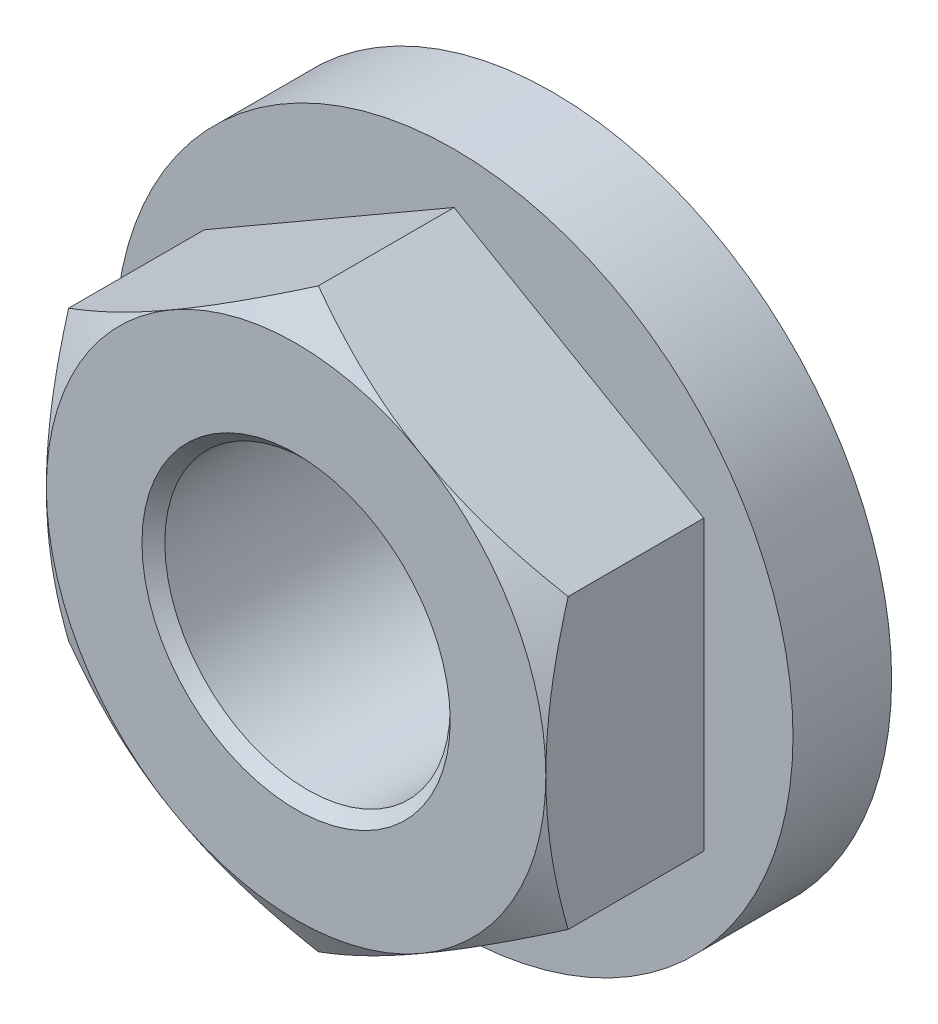
ISO-10303-21;
HEADER;
FILE_DESCRIPTION(('STEP AP214'),'2;1');
FILE_NAME('part.step','',(''),(''),'','','');
FILE_SCHEMA(('AUTOMOTIVE_DESIGN { 1 0 10303 214 1 1 1 1 }'));
ENDSEC;
DATA;
#1=APPLICATION_CONTEXT('core data for automotive mechanical design processes');
#2=APPLICATION_PROTOCOL_DEFINITION('international standard','automotive_design',2000,#1);
#3=PRODUCT_CONTEXT('',#1,'mechanical');
#4=PRODUCT('Part','Part','',(#3));
#5=PRODUCT_RELATED_PRODUCT_CATEGORY('part','',(#4));
#6=PRODUCT_DEFINITION_FORMATION('','',#4);
#7=PRODUCT_DEFINITION_CONTEXT('part definition',#1,'design');
#8=PRODUCT_DEFINITION('design','',#6,#7);
#9=PRODUCT_DEFINITION_SHAPE('','',#8);
#10=(LENGTH_UNIT() NAMED_UNIT(*) SI_UNIT(.MILLI.,.METRE.));
#11=(NAMED_UNIT(*) PLANE_ANGLE_UNIT() SI_UNIT($,.RADIAN.));
#12=(NAMED_UNIT(*) SI_UNIT($,.STERADIAN.) SOLID_ANGLE_UNIT());
#13=UNCERTAINTY_MEASURE_WITH_UNIT(LENGTH_MEASURE(1.E-05),#10,'distance_accuracy_value','');
#14=(GEOMETRIC_REPRESENTATION_CONTEXT(3) GLOBAL_UNCERTAINTY_ASSIGNED_CONTEXT((#13)) GLOBAL_UNIT_ASSIGNED_CONTEXT((#10,
#11,#12)) REPRESENTATION_CONTEXT('',''));
#15=CARTESIAN_POINT('',(0.,0.,0.));
#16=DIRECTION('',(0.,0.,1.));
#17=DIRECTION('',(1.,0.,0.));
#18=AXIS2_PLACEMENT_3D('',#15,#16,#17);
#19=CARTESIAN_POINT('',(0.,0.,-3.514725));
#20=DIRECTION('',(0.,0.,-1.));
#21=DIRECTION('',(-1.,0.,0.));
#22=AXIS2_PLACEMENT_3D('',#19,#20,#21);
#23=CYLINDRICAL_SURFACE('',#22,7.540625);
#24=CARTESIAN_POINT('',(0.,0.,-3.514725));
#25=DIRECTION('',(0.,0.,-1.));
#26=DIRECTION('',(-1.,0.,0.));
#27=AXIS2_PLACEMENT_3D('',#24,#25,#26);
#28=CIRCLE('',#27,7.540625);
#29=CARTESIAN_POINT('',(-7.540625,0.,-3.514725));
#30=VERTEX_POINT('',#29);
#31=EDGE_CURVE('E135',#30,#30,#28,.T.);
#32=ORIENTED_EDGE('',*,*,#31,.T.);
#33=EDGE_LOOP('',(#32));
#34=FACE_BOUND('',#33,.T.);
#35=CARTESIAN_POINT('',(0.,0.,-5.709285));
#36=DIRECTION('',(0.,0.,-1.));
#37=DIRECTION('',(-1.,0.,0.));
#38=AXIS2_PLACEMENT_3D('',#35,#36,#37);
#39=CIRCLE('',#38,7.540625);
#40=CARTESIAN_POINT('',(-7.540625,0.,-5.709285));
#41=VERTEX_POINT('',#40);
#42=EDGE_CURVE('E42',#41,#41,#39,.F.);
#43=ORIENTED_EDGE('',*,*,#42,.T.);
#44=EDGE_LOOP('',(#43));
#45=FACE_BOUND('',#44,.T.);
#46=ADVANCED_FACE('F37',(#34,#45),#23,.T.);
#47=CARTESIAN_POINT('',(-5.55625,9.62370729955457,-5.953125));
#48=DIRECTION('',(0.,0.,1.));
#49=DIRECTION('',(1.,0.,0.));
#50=AXIS2_PLACEMENT_3D('',#47,#48,#49);
#51=PLANE('',#50);
#52=CARTESIAN_POINT('',(0.,0.,-5.953125));
#53=DIRECTION('',(0.,0.,-1.));
#54=DIRECTION('',(-1.,0.,0.));
#55=AXIS2_PLACEMENT_3D('',#52,#53,#54);
#56=CIRCLE('',#55,3.429);
#57=CARTESIAN_POINT('',(-3.429,0.,-5.953125));
#58=VERTEX_POINT('',#57);
#59=EDGE_CURVE('E248',#58,#58,#56,.T.);
#60=ORIENTED_EDGE('',*,*,#59,.F.);
#61=EDGE_LOOP('',(#60));
#62=FACE_BOUND('',#61,.T.);
#63=CARTESIAN_POINT('',(0.,0.,-5.953125));
#64=DIRECTION('',(0.,0.,-1.));
#65=DIRECTION('',(-1.,0.,0.));
#66=AXIS2_PLACEMENT_3D('',#63,#64,#65);
#67=CIRCLE('',#66,5.461);
#68=CARTESIAN_POINT('',(-5.461,0.,-5.953125));
#69=VERTEX_POINT('',#68);
#70=EDGE_CURVE('E252',#69,#69,#67,.T.);
#71=ORIENTED_EDGE('',*,*,#70,.T.);
#72=EDGE_LOOP('',(#71));
#73=FACE_BOUND('',#72,.T.);
#74=ADVANCED_FACE('F223',(#62,#73),#51,.F.);
#75=CARTESIAN_POINT('',(5.55625,3.20790243318486,-5.953125));
#76=DIRECTION('',(0.5,0.866025403784439,0.));
#77=DIRECTION('',(-0.866025403784439,0.5,0.));
#78=AXIS2_PLACEMENT_3D('',#75,#76,#77);
#79=PLANE('',#78);
#80=DIRECTION('',(0.,0.,1.));
#81=VECTOR('',#80,1.);
#82=CARTESIAN_POINT('',(0.,6.41580486636972,-5.953125));
#83=LINE('',#82,#81);
#84=CARTESIAN_POINT('',(0.,6.41580486636972,-3.514725));
#85=VERTEX_POINT('',#84);
#86=CARTESIAN_POINT('',(0.,6.41580486636972,-0.496264233481805));
#87=VERTEX_POINT('',#86);
#88=EDGE_CURVE('E134',#85,#87,#83,.T.);
#89=ORIENTED_EDGE('',*,*,#88,.T.);
#90=CARTESIAN_POINT('',(-0.00020000000000129,6.41592033642355,-0.496330901948214));
#91=CARTESIAN_POINT('',(0.12193299556773,6.34540681855559,-0.45562556037127));
#92=CARTESIAN_POINT('',(0.244521362426352,6.27463039195025,-0.416767539363197));
#93=CARTESIAN_POINT('',(0.490693649442354,6.13250275577453,-0.343254933424579));
#94=CARTESIAN_POINT('',(0.614277974736486,6.06115131229835,-0.308602161801911));
#95=CARTESIAN_POINT('',(0.98700972080066,5.84595453837268,-0.211631885561129));
#96=CARTESIAN_POINT('',(1.2376284511895,5.70125974691872,-0.156476054502036));
#97=CARTESIAN_POINT('',(1.61267482827954,5.48472662014719,-0.0917989048470063));
#98=CARTESIAN_POINT('',(1.73598185211002,5.41353527674569,-0.0733741703626362));
#99=CARTESIAN_POINT('',(1.98315307742221,5.27083090327577,-0.0424783662403559));
#100=CARTESIAN_POINT('',(2.10701722869746,5.19931790219406,-0.0300067705620299));
#101=CARTESIAN_POINT('',(2.35496067331701,5.05616768769916,-0.0113350865982913));
#102=CARTESIAN_POINT('',(2.47903956167444,4.98453070810525,-0.00512788068338393));
#103=CARTESIAN_POINT('',(2.72730512667549,4.84119451732138,0.000888582586164164));
#104=CARTESIAN_POINT('',(2.85149179987105,4.76949530812215,0.000698037572721128));
#105=CARTESIAN_POINT('',(3.1917275625322,4.5730600989618,-0.0086182426929013));
#106=CARTESIAN_POINT('',(3.40766529229081,4.44838839255747,-0.024259659689411));
#107=CARTESIAN_POINT('',(3.83810650276474,4.19987304382004,-0.073859904974556));
#108=CARTESIAN_POINT('',(4.05260846955284,4.07603027555323,-0.107835688266667));
#109=CARTESIAN_POINT('',(4.48391602670835,3.82701474132597,-0.192765750048085));
#110=CARTESIAN_POINT('',(4.7006671909081,3.70187339832808,-0.244079888042122));
#111=CARTESIAN_POINT('',(5.13093704534075,3.45345698204721,-0.360542455292395));
#112=CARTESIAN_POINT('',(5.34446124641438,3.33017872707885,-0.425663525879434));
#113=CARTESIAN_POINT('',(5.55645,3.20778696313102,-0.496330901948212));
#114=B_SPLINE_CURVE_WITH_KNOTS('',3,(#90,#91,#92,#93,#94,#95,#96,#97,#98,#99,#100,#101,#102,
#103,#104,#105,#106,#107,#108,#109,#110,#111,#112,#113),.UNSPECIFIED.,.F.,.F.,(4,2,2,2,2,2,2,2,
2,2,2,4),(0.,0.440316908268041,0.880823012040823,1.76366572331169,2.19427472390783,
2.62484566732156,3.05492684132792,3.48499472977669,4.23370964386674,4.98311813377593,
5.74914806559356,6.51367405016872),.UNSPECIFIED.);
#115=CARTESIAN_POINT('',(2.778125,4.81185364977729,0.));
#116=VERTEX_POINT('',#115);
#117=EDGE_CURVE('E64',#87,#116,#114,.T.);
#118=ORIENTED_EDGE('',*,*,#117,.T.);
#119=CARTESIAN_POINT('',(5.55625,3.20790243318486,-0.496264233481803));
#120=VERTEX_POINT('',#119);
#121=EDGE_CURVE('E111',#116,#120,#114,.T.);
#122=ORIENTED_EDGE('',*,*,#121,.T.);
#123=DIRECTION('',(0.,0.,1.));
#124=VECTOR('',#123,1.);
#125=CARTESIAN_POINT('',(5.55625,3.20790243318486,-5.953125));
#126=LINE('',#125,#124);
#127=CARTESIAN_POINT('',(5.55625,3.20790243318486,-3.514725));
#128=VERTEX_POINT('',#127);
#129=EDGE_CURVE('E427',#128,#120,#126,.T.);
#130=ORIENTED_EDGE('',*,*,#129,.F.);
#131=DIRECTION('',(-0.866025403784439,0.5,0.));
#132=VECTOR('',#131,1.);
#133=CARTESIAN_POINT('',(5.55625,3.20790243318486,-3.514725));
#134=LINE('',#133,#132);
#135=EDGE_CURVE('E420',#128,#85,#134,.T.);
#136=ORIENTED_EDGE('',*,*,#135,.T.);
#137=EDGE_LOOP('',(#89,#118,#122,#130,#136));
#138=FACE_BOUND('',#137,.T.);
#139=ADVANCED_FACE('F39',(#138),#79,.T.);
#140=CARTESIAN_POINT('',(5.55625,-3.20790243318486,-5.953125));
#141=DIRECTION('',(1.,0.,0.));
#142=DIRECTION('',(0.,1.,0.));
#143=AXIS2_PLACEMENT_3D('',#140,#141,#142);
#144=PLANE('',#143);
#145=ORIENTED_EDGE('',*,*,#129,.T.);
#146=CARTESIAN_POINT('',(5.55625,-8.68399491005474,-2.74423112435443));
#147=CARTESIAN_POINT('',(5.55625,-8.44071238813783,-2.62594874146931));
#148=CARTESIAN_POINT('',(5.55625,-8.19687848881087,-2.5087813509356));
#149=CARTESIAN_POINT('',(5.55625,-7.7078149113579,-2.27730243738019));
#150=CARTESIAN_POINT('',(5.55625,-7.4625850263919,-2.16299135184691));
#151=CARTESIAN_POINT('',(5.55625,-6.96920529927723,-1.9372903200783));
#152=CARTESIAN_POINT('',(5.55625,-6.72104686846765,-1.82591908493359));
#153=CARTESIAN_POINT('',(5.55625,-6.22277921483376,-1.60764641646315));
#154=CARTESIAN_POINT('',(5.55625,-5.97267008295778,-1.50074477621043));
#155=CARTESIAN_POINT('',(5.55625,-5.46184428471539,-1.28916851922616));
#156=CARTESIAN_POINT('',(5.55625,-5.20104909427566,-1.18468247582605));
#157=CARTESIAN_POINT('',(5.55625,-4.67643244649863,-0.983456930570629));
#158=CARTESIAN_POINT('',(5.55625,-4.41261065705376,-0.886718288311942));
#159=CARTESIAN_POINT('',(5.55625,-3.88199419375103,-0.703477214265698));
#160=CARTESIAN_POINT('',(5.55625,-3.61520654148642,-0.616954646815536));
#161=CARTESIAN_POINT('',(5.55625,-3.07780215682032,-0.456878254095176));
#162=CARTESIAN_POINT('',(5.55625,-2.80718663728072,-0.383320416154831));
#163=CARTESIAN_POINT('',(5.55625,-2.26346638368936,-0.253041663234111));
#164=CARTESIAN_POINT('',(5.55625,-1.99038396194594,-0.196229098730025));
#165=CARTESIAN_POINT('',(5.55625,-1.44071558084913,-0.102629100235993));
#166=CARTESIAN_POINT('',(5.55625,-1.16412998782184,-0.0658395898427517));
#167=CARTESIAN_POINT('',(5.55625,-0.749562558844788,-0.0281119845697549));
#168=CARTESIAN_POINT('',(5.55625,-0.612340888492093,-0.0184532824013619));
#169=CARTESIAN_POINT('',(5.55625,-0.337616393410628,-0.00494664379792282));
#170=CARTESIAN_POINT('',(5.55625,-0.200113596220077,-0.00109816318166069));
#171=CARTESIAN_POINT('',(5.55625,0.0749421323474005,0.000691163131830924));
#172=CARTESIAN_POINT('',(5.55625,0.212495067091348,-0.00136851565554075));
#173=CARTESIAN_POINT('',(5.55625,0.487378845950658,-0.0113432883721766));
#174=CARTESIAN_POINT('',(5.55625,0.624709698074534,-0.0192581662155256));
#175=CARTESIAN_POINT('',(5.55625,0.95268850348551,-0.0449839380863666));
#176=CARTESIAN_POINT('',(5.55625,1.14313211985452,-0.0654579630895699));
#177=CARTESIAN_POINT('',(5.55625,1.52264130373992,-0.116565201640638));
#178=CARTESIAN_POINT('',(5.55625,1.71170668881073,-0.147199736111147));
#179=CARTESIAN_POINT('',(5.55625,2.27659405119699,-0.252722614390295));
#180=CARTESIAN_POINT('',(5.55625,2.64991074841381,-0.341212748653213));
#181=CARTESIAN_POINT('',(5.55625,3.20833213149729,-0.495145496191675));
#182=CARTESIAN_POINT('',(5.55625,3.39631843234373,-0.550739366801617));
#183=CARTESIAN_POINT('',(5.55625,3.77046569824234,-0.667817801385444));
#184=CARTESIAN_POINT('',(5.55625,3.95662664981014,-0.729302408839805));
#185=CARTESIAN_POINT('',(5.55625,4.3271813920907,-0.857165983664275));
#186=CARTESIAN_POINT('',(5.55625,4.51157570000081,-0.92354346585959));
#187=CARTESIAN_POINT('',(5.55625,4.87882686733377,-1.06040000970379));
#188=CARTESIAN_POINT('',(5.55625,5.06168375717878,-1.13087898997335));
#189=CARTESIAN_POINT('',(5.55625,5.53931341885732,-1.32014425816687));
#190=CARTESIAN_POINT('',(5.55625,5.83297980522752,-1.44171947509402));
#191=CARTESIAN_POINT('',(5.55625,6.41742433242896,-1.69164766096787));
#192=CARTESIAN_POINT('',(5.55624999999999,6.70820219189244,-1.82000128264598));
#193=CARTESIAN_POINT('',(5.55624999999999,7.28750450729358,-2.08193685782405));
#194=CARTESIAN_POINT('',(5.55624999999999,7.57602816714153,-2.21552056639607));
#195=CARTESIAN_POINT('',(5.55624999999999,8.1511607736309,-2.48670988867802));
#196=CARTESIAN_POINT('',(5.55624999999999,8.4377697868052,-2.62431536173138));
#197=CARTESIAN_POINT('',(5.55624999999999,9.00985857817239,-2.90290272486426));
#198=CARTESIAN_POINT('',(5.55624999999999,9.29533608720508,-3.04388926561472));
#199=CARTESIAN_POINT('',(5.55624999999999,9.86501872870687,-3.32841040468712));
#200=CARTESIAN_POINT('',(5.55624999999999,10.1492238521068,-3.47194502113488));
#201=CARTESIAN_POINT('',(5.55624999999999,11.0001638399101,-3.90555834554313));
#202=CARTESIAN_POINT('',(5.55624999999999,11.5653362706018,-4.19870204812455));
#203=CARTESIAN_POINT('',(5.55624999999999,12.6361469569359,-4.76078496572285));
#204=CARTESIAN_POINT('',(5.55624999999999,13.1420628655974,-5.02919773815537));
#205=CARTESIAN_POINT('',(5.55624999999999,14.1521616738707,-5.5693281145757));
#206=CARTESIAN_POINT('',(5.55624999999999,14.6563444780897,-5.84104589685548));
#207=CARTESIAN_POINT('',(5.55624999999999,15.6618068300488,-6.38609209435569));
#208=CARTESIAN_POINT('',(5.55624999999999,16.1630905297018,-6.65941286244854));
#209=CARTESIAN_POINT('',(5.55624999999999,17.1645728087885,-7.20795098937644));
#210=CARTESIAN_POINT('',(5.55624999999999,17.6647714635511,-7.48316821062431));
#211=CARTESIAN_POINT('',(5.55624999999999,18.1645847485322,-7.75907911977834));
#212=B_SPLINE_CURVE_WITH_KNOTS('',3,(#146,#147,#148,#149,#150,#151,#152,#153,#154,#155,#156,
#157,#158,#159,#160,#161,#162,#163,#164,#165,#166,#167,#168,#169,#170,#171,#172,#173,#174,#175,
#176,#177,#178,#179,#180,#181,#182,#183,#184,#185,#186,#187,#188,#189,#190,#191,#192,#193,#194,
#195,#196,#197,#198,#199,#200,#201,#202,#203,#204,#205,#206,#207,#208,#209,#210,#211),
.UNSPECIFIED.,.F.,.F.,(4,2,2,2,2,2,2,2,2,2,2,2,2,2,2,2,2,2,2,2,2,2,2,2,2,2,2,2,2,2,2,2,4),(0.,
0.811547630396048,1.62321880955349,2.43919539124873,3.25513415408659,4.09788141298698,
4.94072204796686,5.78187270596739,6.62276256330883,7.45896078973326,8.29507228534598,
8.70765151088547,9.12019209215055,9.53276929698372,9.9453312764292,10.5196314608684,
11.0940063368051,12.2433452126182,12.8313978126471,13.4194547535213,14.0073339258551,
14.5952014378355,15.5485884923271,16.5020675219184,17.4558693020792,18.4096377639481,
19.3648033529993,20.3199757393717,22.229942984196,23.9480593030972,25.6662687221983,
27.3791293174056,29.0918669266135),.UNSPECIFIED.);
#213=CARTESIAN_POINT('',(5.55625,0.,0.));
#214=VERTEX_POINT('',#213);
#215=EDGE_CURVE('E114',#120,#214,#212,.F.);
#216=ORIENTED_EDGE('',*,*,#215,.T.);
#217=CARTESIAN_POINT('',(5.55625,-3.20790243318486,-0.496264233481805));
#218=VERTEX_POINT('',#217);
#219=EDGE_CURVE('E145',#214,#218,#212,.F.);
#220=ORIENTED_EDGE('',*,*,#219,.T.);
#221=DIRECTION('',(0.,0.,1.));
#222=VECTOR('',#221,1.);
#223=CARTESIAN_POINT('',(5.55625,-3.20790243318486,-5.953125));
#224=LINE('',#223,#222);
#225=CARTESIAN_POINT('',(5.55625,-3.20790243318486,-3.514725));
#226=VERTEX_POINT('',#225);
#227=EDGE_CURVE('E434',#226,#218,#224,.T.);
#228=ORIENTED_EDGE('',*,*,#227,.F.);
#229=DIRECTION('',(0.,1.,0.));
#230=VECTOR('',#229,1.);
#231=CARTESIAN_POINT('',(5.55625,-3.20790243318486,-3.514725));
#232=LINE('',#231,#230);
#233=EDGE_CURVE('E423',#226,#128,#232,.T.);
#234=ORIENTED_EDGE('',*,*,#233,.T.);
#235=EDGE_LOOP('',(#145,#216,#220,#228,#234));
#236=FACE_BOUND('',#235,.T.);
#237=ADVANCED_FACE('F201',(#236),#144,.T.);
#238=CARTESIAN_POINT('',(0.,-6.41580486636972,-5.953125));
#239=DIRECTION('',(0.5,-0.866025403784439,0.));
#240=DIRECTION('',(0.866025403784439,0.5,0.));
#241=AXIS2_PLACEMENT_3D('',#238,#239,#240);
#242=PLANE('',#241);
#243=ORIENTED_EDGE('',*,*,#227,.T.);
#244=CARTESIAN_POINT('',(5.55645,-3.20778696313103,-0.496330901948214));
#245=CARTESIAN_POINT('',(5.43431700443226,-3.27830048099899,-0.455625560371269));
#246=CARTESIAN_POINT('',(5.31172863757364,-3.34907690760433,-0.416767539363196));
#247=CARTESIAN_POINT('',(5.06555635055764,-3.49120454378005,-0.343254933424579));
#248=CARTESIAN_POINT('',(4.94197202526351,-3.56255598725623,-0.308602161801911));
#249=CARTESIAN_POINT('',(4.56924027919933,-3.7777527611819,-0.21163188556113));
#250=CARTESIAN_POINT('',(4.31862154881049,-3.92244755263586,-0.156476054502037));
#251=CARTESIAN_POINT('',(3.94357517172046,-4.13898067940739,-0.091798904847007));
#252=CARTESIAN_POINT('',(3.82026814788997,-4.21017202280889,-0.073374170362637));
#253=CARTESIAN_POINT('',(3.57309692257778,-4.35287639627881,-0.0424783662403568));
#254=CARTESIAN_POINT('',(3.44923277130253,-4.42438939736052,-0.0300067705620312));
#255=CARTESIAN_POINT('',(3.20128932668298,-4.56753961185542,-0.0113350865982923));
#256=CARTESIAN_POINT('',(3.07721043832556,-4.63917659144933,-0.00512788068338454));
#257=CARTESIAN_POINT('',(2.82894487332451,-4.7825127822332,0.000888582586163022));
#258=CARTESIAN_POINT('',(2.70475820012895,-4.85421199143242,0.000698037572719024));
#259=CARTESIAN_POINT('',(2.36452243746779,-5.05064720059278,-0.0086182426929045));
#260=CARTESIAN_POINT('',(2.14858470770919,-5.17531890699711,-0.0242596596894132));
#261=CARTESIAN_POINT('',(1.71814349723526,-5.42383425573454,-0.0738599049745579));
#262=CARTESIAN_POINT('',(1.50364153044716,-5.54767702400135,-0.10783568826667));
#263=CARTESIAN_POINT('',(1.07233397329164,-5.79669255822861,-0.192765750048088));
#264=CARTESIAN_POINT('',(0.855582809091897,-5.92183390122649,-0.244079888042125));
#265=CARTESIAN_POINT('',(0.425312954659247,-6.17025031750737,-0.360542455292398));
#266=CARTESIAN_POINT('',(0.21178875358562,-6.29352857247572,-0.425663525879437));
#267=CARTESIAN_POINT('',(-0.00020000000000079,-6.41592033642356,-0.496330901948215));
#268=B_SPLINE_CURVE_WITH_KNOTS('',3,(#244,#245,#246,#247,#248,#249,#250,#251,#252,#253,#254,
#255,#256,#257,#258,#259,#260,#261,#262,#263,#264,#265,#266,#267),.UNSPECIFIED.,.F.,.F.,(4,2,2,
2,2,2,2,2,2,2,2,4),(0.,0.440316908268041,0.880823012040823,1.76366572331169,2.19427472390783,
2.62484566732156,3.05492684132792,3.48499472977669,4.23370964386674,4.98311813377593,
5.74914806559356,6.51367405016872),.UNSPECIFIED.);
#269=CARTESIAN_POINT('',(2.778125,-4.81185364977729,0.));
#270=VERTEX_POINT('',#269);
#271=EDGE_CURVE('E195',#218,#270,#268,.T.);
#272=ORIENTED_EDGE('',*,*,#271,.T.);
#273=CARTESIAN_POINT('',(0.,-6.41580486636972,-0.496264233481806));
#274=VERTEX_POINT('',#273);
#275=EDGE_CURVE('E188',#270,#274,#268,.T.);
#276=ORIENTED_EDGE('',*,*,#275,.T.);
#277=DIRECTION('',(0.,0.,1.));
#278=VECTOR('',#277,1.);
#279=CARTESIAN_POINT('',(0.,-6.41580486636972,-5.953125));
#280=LINE('',#279,#278);
#281=CARTESIAN_POINT('',(0.,-6.41580486636972,-3.514725));
#282=VERTEX_POINT('',#281);
#283=EDGE_CURVE('E438',#282,#274,#280,.T.);
#284=ORIENTED_EDGE('',*,*,#283,.F.);
#285=DIRECTION('',(0.866025403784439,0.5,0.));
#286=VECTOR('',#285,1.);
#287=CARTESIAN_POINT('',(0.,-6.41580486636972,-3.514725));
#288=LINE('',#287,#286);
#289=EDGE_CURVE('E444',#282,#226,#288,.T.);
#290=ORIENTED_EDGE('',*,*,#289,.T.);
#291=EDGE_LOOP('',(#243,#272,#276,#284,#290));
#292=FACE_BOUND('',#291,.T.);
#293=ADVANCED_FACE('F197',(#292),#242,.T.);
#294=CARTESIAN_POINT('',(-5.55625,-3.20790243318486,-5.953125));
#295=DIRECTION('',(-0.5,-0.866025403784439,0.));
#296=DIRECTION('',(0.866025403784439,-0.5,0.));
#297=AXIS2_PLACEMENT_3D('',#294,#295,#296);
#298=PLANE('',#297);
#299=ORIENTED_EDGE('',*,*,#283,.T.);
#300=CARTESIAN_POINT('',(0.000199999999999385,-6.41592033642356,-0.496330901948215));
#301=CARTESIAN_POINT('',(-0.121932995567732,-6.34540681855559,-0.455625560371271));
#302=CARTESIAN_POINT('',(-0.244521362426354,-6.27463039195025,-0.416767539363198));
#303=CARTESIAN_POINT('',(-0.490693649442357,-6.13250275577453,-0.343254933424581));
#304=CARTESIAN_POINT('',(-0.614277974736488,-6.06115131229835,-0.308602161801913));
#305=CARTESIAN_POINT('',(-0.987009720800663,-5.84595453837268,-0.211631885561131));
#306=CARTESIAN_POINT('',(-1.2376284511895,-5.70125974691872,-0.156476054502039));
#307=CARTESIAN_POINT('',(-1.61267482827954,-5.48472662014719,-0.0917989048470077));
#308=CARTESIAN_POINT('',(-1.73598185211002,-5.41353527674569,-0.0733741703626372));
#309=CARTESIAN_POINT('',(-1.98315307742222,-5.27083090327577,-0.0424783662403569));
#310=CARTESIAN_POINT('',(-2.10701722869746,-5.19931790219406,-0.0300067705620317));
#311=CARTESIAN_POINT('',(-2.35496067331702,-5.05616768769916,-0.011335086598293));
#312=CARTESIAN_POINT('',(-2.47903956167444,-4.98453070810525,-0.00512788068338511));
#313=CARTESIAN_POINT('',(-2.72730512667549,-4.84119451732138,0.000888582586162839));
#314=CARTESIAN_POINT('',(-2.85149179987105,-4.76949530812216,0.000698037572719076));
#315=CARTESIAN_POINT('',(-3.19172756253221,-4.5730600989618,-0.00861824269290391));
#316=CARTESIAN_POINT('',(-3.40766529229081,-4.44838839255747,-0.0242596596894124));
#317=CARTESIAN_POINT('',(-3.83810650276474,-4.19987304382004,-0.0738599049745569));
#318=CARTESIAN_POINT('',(-4.05260846955284,-4.07603027555323,-0.107835688266669));
#319=CARTESIAN_POINT('',(-4.48391602670836,-3.82701474132597,-0.192765750048088));
#320=CARTESIAN_POINT('',(-4.7006671909081,-3.70187339832808,-0.244079888042125));
#321=CARTESIAN_POINT('',(-5.13093704534075,-3.45345698204721,-0.360542455292398));
#322=CARTESIAN_POINT('',(-5.34446124641438,-3.33017872707885,-0.425663525879437));
#323=CARTESIAN_POINT('',(-5.55645,-3.20778696313102,-0.496330901948215));
#324=B_SPLINE_CURVE_WITH_KNOTS('',3,(#300,#301,#302,#303,#304,#305,#306,#307,#308,#309,#310,
#311,#312,#313,#314,#315,#316,#317,#318,#319,#320,#321,#322,#323),.UNSPECIFIED.,.F.,.F.,(4,2,2,
2,2,2,2,2,2,2,2,4),(0.,0.440316908268041,0.880823012040824,1.76366572331169,2.19427472390783,
2.62484566732156,3.05492684132792,3.4849947297767,4.23370964386675,4.98311813377593,
5.74914806559357,6.51367405016873),.UNSPECIFIED.);
#325=CARTESIAN_POINT('',(-2.778125,-4.81185364977729,0.));
#326=VERTEX_POINT('',#325);
#327=EDGE_CURVE('E196',#274,#326,#324,.T.);
#328=ORIENTED_EDGE('',*,*,#327,.T.);
#329=CARTESIAN_POINT('',(-5.55625,-3.20790243318534,-0.496264233481485));
#330=VERTEX_POINT('',#329);
#331=EDGE_CURVE('E182',#326,#330,#324,.T.);
#332=ORIENTED_EDGE('',*,*,#331,.T.);
#333=DIRECTION('',(0.,0.,1.));
#334=VECTOR('',#333,1.);
#335=CARTESIAN_POINT('',(-5.55625,-3.20790243318486,-5.953125));
#336=LINE('',#335,#334);
#337=CARTESIAN_POINT('',(-5.55625,-3.20790243318486,-3.514725));
#338=VERTEX_POINT('',#337);
#339=EDGE_CURVE('E415',#338,#330,#336,.T.);
#340=ORIENTED_EDGE('',*,*,#339,.F.);
#341=DIRECTION('',(0.866025403784439,-0.5,0.));
#342=VECTOR('',#341,1.);
#343=CARTESIAN_POINT('',(-5.55625,-3.20790243318486,-3.514725));
#344=LINE('',#343,#342);
#345=EDGE_CURVE('E443',#338,#282,#344,.T.);
#346=ORIENTED_EDGE('',*,*,#345,.T.);
#347=EDGE_LOOP('',(#299,#328,#332,#340,#346));
#348=FACE_BOUND('',#347,.T.);
#349=ADVANCED_FACE('F200',(#348),#298,.T.);
#350=CARTESIAN_POINT('',(-5.55625,3.20790243318486,-5.953125));
#351=DIRECTION('',(-1.,0.,0.));
#352=DIRECTION('',(0.,-1.,0.));
#353=AXIS2_PLACEMENT_3D('',#350,#351,#352);
#354=PLANE('',#353);
#355=ORIENTED_EDGE('',*,*,#339,.T.);
#356=CARTESIAN_POINT('',(-5.55625,-8.68399490865763,-2.74423112367499));
#357=CARTESIAN_POINT('',(-5.55625,-8.44071238678772,-2.62594874081824));
#358=CARTESIAN_POINT('',(-5.55625,-8.1968784875078,-2.50878135031289));
#359=CARTESIAN_POINT('',(-5.55625,-7.70781491014905,-2.27730243681407));
#360=CARTESIAN_POINT('',(-5.55625,-7.46258502523023,-2.16299135130901));
#361=CARTESIAN_POINT('',(-5.55625,-6.96920529821065,-1.93729031959688));
#362=CARTESIAN_POINT('',(-5.55625,-6.72104686744898,-1.8259190844804));
#363=CARTESIAN_POINT('',(-5.55625,-6.22277921391125,-1.60764641606598));
#364=CARTESIAN_POINT('',(-5.55625,-5.9726700820835,-1.50074477584103));
#365=CARTESIAN_POINT('',(-5.55625,-5.46184428394125,-1.28916851891306));
#366=CARTESIAN_POINT('',(-5.55625,-5.20104909355346,-1.18468247554142));
#367=CARTESIAN_POINT('',(-5.55625,-4.67643244588114,-0.983456930341409));
#368=CARTESIAN_POINT('',(-5.55625,-4.41261065648904,-0.886718288109666));
#369=CARTESIAN_POINT('',(-5.55625,-3.88199419329285,-0.703477214114723));
#370=CARTESIAN_POINT('',(-5.55625,-3.61520654108199,-0.616954646688927));
#371=CARTESIAN_POINT('',(-5.55625,-3.07780215652486,-0.456878254013309));
#372=CARTESIAN_POINT('',(-5.55625,-2.80718663704047,-0.383320416093342));
#373=CARTESIAN_POINT('',(-5.55625,-2.26346638358799,-0.253041663213731));
#374=CARTESIAN_POINT('',(-5.55625,-1.99038396192862,-0.196229098728786));
#375=CARTESIAN_POINT('',(-5.55625,-1.44071558100195,-0.102629100260319));
#376=CARTESIAN_POINT('',(-5.55625,-1.16412998806076,-0.0658395898735119));
#377=CARTESIAN_POINT('',(-5.55625,-0.749562559212246,-0.028111984598734));
#378=CARTESIAN_POINT('',(-5.55625,-0.61234088890178,-0.018453282427893));
#379=CARTESIAN_POINT('',(-5.55625,-0.337616393904681,-0.00494664381583912));
#380=CARTESIAN_POINT('',(-5.55625,-0.200113596756267,-0.00109816319341067));
#381=CARTESIAN_POINT('',(-5.55625,0.0749421317272436,0.000691163136054456));
#382=CARTESIAN_POINT('',(-5.55625,0.212495066429362,-0.00136851564150872));
#383=CARTESIAN_POINT('',(-5.55625,0.48737884520557,-0.0113432883351523));
#384=CARTESIAN_POINT('',(-5.55625,0.624709697288174,-0.0192581661653177));
#385=CARTESIAN_POINT('',(-5.55625,0.952688502635255,-0.0449839380037341));
#386=CARTESIAN_POINT('',(-5.55625,1.14313211898183,-0.0654579629882622));
#387=CARTESIAN_POINT('',(-5.55625,1.52264130282336,-0.116565201500979));
#388=CARTESIAN_POINT('',(-5.55625,1.71170668787275,-0.147199735951811));
#389=CARTESIAN_POINT('',(-5.55625,2.27659405019588,-0.252722614171514));
#390=CARTESIAN_POINT('',(-5.55625,2.64991074737226,-0.341212748394274));
#391=CARTESIAN_POINT('',(-5.55625,3.20833213039524,-0.495145495873464));
#392=CARTESIAN_POINT('',(-5.55625,3.39631843122109,-0.55073936646351));
#393=CARTESIAN_POINT('',(-5.55625,3.77046569707873,-0.667817801008148));
#394=CARTESIAN_POINT('',(-5.55625,3.95662664862616,-0.729302408443215));
#395=CARTESIAN_POINT('',(-5.55625,4.32718139086614,-0.85716598322978));
#396=CARTESIAN_POINT('',(-5.55625,4.51157569875603,-0.923543465406485));
#397=CARTESIAN_POINT('',(-5.55625,4.87882686604855,-1.06040000921411));
#398=CARTESIAN_POINT('',(-5.55625,5.06168375587333,-1.13087898946569));
#399=CARTESIAN_POINT('',(-5.55625,5.53931341753975,-1.3201442576291));
#400=CARTESIAN_POINT('',(-5.55625,5.83297980391751,-1.44171947454583));
#401=CARTESIAN_POINT('',(-5.55625,6.4174243311331,-1.69164766040173));
#402=CARTESIAN_POINT('',(-5.55625,6.70820219060318,-1.82000128207232));
#403=CARTESIAN_POINT('',(-5.55625,7.28750450601683,-2.08193685723748));
#404=CARTESIAN_POINT('',(-5.55625,7.57602816587069,-2.2155205658041));
#405=CARTESIAN_POINT('',(-5.55625,8.15116077237124,-2.48670988807679));
#406=CARTESIAN_POINT('',(-5.55625,8.4377697855508,-2.62431536112629));
#407=CARTESIAN_POINT('',(-5.55625,9.00985857692835,-2.90290272425271));
#408=CARTESIAN_POINT('',(-5.55625,9.29533608596613,-3.04388926500057));
#409=CARTESIAN_POINT('',(-5.55625,9.86501872747772,-3.32841040406864));
#410=CARTESIAN_POINT('',(-5.55625,10.1492238508824,-3.47194502051465));
#411=CARTESIAN_POINT('',(-5.55625,11.0001638386992,-3.9055583449186));
#412=CARTESIAN_POINT('',(-5.55625,11.5653362693993,-4.19870204749842));
#413=CARTESIAN_POINT('',(-5.55625,12.6361469557419,-4.76078496509157));
#414=CARTESIAN_POINT('',(-5.55625,13.1420628644035,-5.02919773752034));
#415=CARTESIAN_POINT('',(-5.55625,14.1521616726768,-5.56932811393393));
#416=CARTESIAN_POINT('',(-5.55625,14.6563444768956,-5.84104589621072));
#417=CARTESIAN_POINT('',(-5.55625,15.6618068288529,-6.38609209370488));
#418=CARTESIAN_POINT('',(-5.55625,16.1630905285044,-6.65941286179464));
#419=CARTESIAN_POINT('',(-5.55625,17.1645728075876,-7.20795098871674));
#420=CARTESIAN_POINT('',(-5.55625,17.6647714623484,-7.48316820996187));
#421=CARTESIAN_POINT('',(-5.55625,18.1645847473276,-7.75907911911329));
#422=B_SPLINE_CURVE_WITH_KNOTS('',3,(#356,#357,#358,#359,#360,#361,#362,#363,#364,#365,#366,
#367,#368,#369,#370,#371,#372,#373,#374,#375,#376,#377,#378,#379,#380,#381,#382,#383,#384,#385,
#386,#387,#388,#389,#390,#391,#392,#393,#394,#395,#396,#397,#398,#399,#400,#401,#402,#403,#404,
#405,#406,#407,#408,#409,#410,#411,#412,#413,#414,#415,#416,#417,#418,#419,#420,#421),
.UNSPECIFIED.,.F.,.F.,(4,2,2,2,2,2,2,2,2,2,2,2,2,2,2,2,2,2,2,2,2,2,2,2,2,2,2,2,2,2,2,2,4),(0.,
0.811547630232006,1.62321880922538,2.43919539075479,3.25513415342684,4.09788141215085,
4.9407220469543,5.78187270477897,6.62276256194471,7.45896078811112,8.29507228346621,
8.70765150887994,9.1201920900193,9.53276929472667,9.94533127404636,10.5196314584127,
11.0940063342765,12.2433452099435,12.8313978098963,13.4194547506943,14.007333922952,
14.5952014348564,15.5485884893569,16.5020675189572,17.4558692991273,18.4096377610053,
19.3648033500667,20.3199757364494,22.2299429812938,23.9480593001902,25.6662687192865,
27.3791293144852,29.0918669236843),.UNSPECIFIED.);
#423=CARTESIAN_POINT('',(-5.55625,0.,0.));
#424=VERTEX_POINT('',#423);
#425=EDGE_CURVE('E405',#330,#424,#422,.T.);
#426=ORIENTED_EDGE('',*,*,#425,.T.);
#427=CARTESIAN_POINT('',(-5.55625,3.20790243318486,-0.496264233481806));
#428=VERTEX_POINT('',#427);
#429=EDGE_CURVE('E175',#424,#428,#422,.T.);
#430=ORIENTED_EDGE('',*,*,#429,.T.);
#431=DIRECTION('',(0.,0.,1.));
#432=VECTOR('',#431,1.);
#433=CARTESIAN_POINT('',(-5.55625,3.20790243318486,-5.953125));
#434=LINE('',#433,#432);
#435=CARTESIAN_POINT('',(-5.55625,3.20790243318486,-3.514725));
#436=VERTEX_POINT('',#435);
#437=EDGE_CURVE('E419',#436,#428,#434,.T.);
#438=ORIENTED_EDGE('',*,*,#437,.F.);
#439=DIRECTION('',(0.,-1.,0.));
#440=VECTOR('',#439,1.);
#441=CARTESIAN_POINT('',(-5.55625,3.20790243318486,-3.514725));
#442=LINE('',#441,#440);
#443=EDGE_CURVE('E137',#436,#338,#442,.T.);
#444=ORIENTED_EDGE('',*,*,#443,.T.);
#445=EDGE_LOOP('',(#355,#426,#430,#438,#444));
#446=FACE_BOUND('',#445,.T.);
#447=ADVANCED_FACE('F207',(#446),#354,.T.);
#448=CARTESIAN_POINT('',(0.,6.41580486636972,-5.953125));
#449=DIRECTION('',(-0.5,0.866025403784439,0.));
#450=DIRECTION('',(-0.866025403784439,-0.5,0.));
#451=AXIS2_PLACEMENT_3D('',#448,#449,#450);
#452=PLANE('',#451);
#453=ORIENTED_EDGE('',*,*,#437,.T.);
#454=CARTESIAN_POINT('',(-5.55645,3.20778696313102,-0.496330901948216));
#455=CARTESIAN_POINT('',(-5.43431700443227,3.27830048099899,-0.455625560371271));
#456=CARTESIAN_POINT('',(-5.31172863757365,3.34907690760433,-0.416767539363198));
#457=CARTESIAN_POINT('',(-5.06555635055765,3.49120454378004,-0.34325493342458));
#458=CARTESIAN_POINT('',(-4.94197202526351,3.56255598725623,-0.308602161801912));
#459=CARTESIAN_POINT('',(-4.56924027919934,3.7777527611819,-0.211631885561131));
#460=CARTESIAN_POINT('',(-4.3186215488105,3.92244755263586,-0.156476054502038));
#461=CARTESIAN_POINT('',(-3.94357517172046,4.13898067940738,-0.0917989048470075));
#462=CARTESIAN_POINT('',(-3.82026814788998,4.21017202280889,-0.0733741703626371));
#463=CARTESIAN_POINT('',(-3.57309692257779,4.35287639627881,-0.0424783662403571));
#464=CARTESIAN_POINT('',(-3.44923277130254,4.42438939736052,-0.0300067705620319));
#465=CARTESIAN_POINT('',(-3.20128932668299,4.56753961185542,-0.0113350865982928));
#466=CARTESIAN_POINT('',(-3.07721043832556,4.63917659144933,-0.00512788068338447));
#467=CARTESIAN_POINT('',(-2.82894487332451,4.7825127822332,0.000888582586163694));
#468=CARTESIAN_POINT('',(-2.70475820012895,4.85421199143242,0.00069803757271971));
#469=CARTESIAN_POINT('',(-2.36452243746779,5.05064720059278,-0.00861824269290365));
#470=CARTESIAN_POINT('',(-2.14858470770919,5.1753189069971,-0.0242596596894121));
#471=CARTESIAN_POINT('',(-1.71814349723526,5.42383425573453,-0.0738599049745566));
#472=CARTESIAN_POINT('',(-1.50364153044716,5.54767702400135,-0.107835688266668));
#473=CARTESIAN_POINT('',(-1.07233397329164,5.79669255822861,-0.192765750048087));
#474=CARTESIAN_POINT('',(-0.855582809091901,5.92183390122649,-0.244079888042124));
#475=CARTESIAN_POINT('',(-0.42531295465925,6.17025031750736,-0.360542455292397));
#476=CARTESIAN_POINT('',(-0.211788753585623,6.29352857247572,-0.425663525879436));
#477=CARTESIAN_POINT('',(0.000199999999998121,6.41592033642355,-0.496330901948214));
#478=B_SPLINE_CURVE_WITH_KNOTS('',3,(#454,#455,#456,#457,#458,#459,#460,#461,#462,#463,#464,
#465,#466,#467,#468,#469,#470,#471,#472,#473,#474,#475,#476,#477),.UNSPECIFIED.,.F.,.F.,(4,2,2,
2,2,2,2,2,2,2,2,4),(0.,0.440316908268042,0.880823012040824,1.76366572331169,2.19427472390783,
2.62484566732156,3.05492684132792,3.4849947297767,4.23370964386675,4.98311813377593,
5.74914806559356,6.51367405016873),.UNSPECIFIED.);
#479=CARTESIAN_POINT('',(-2.778125,4.81185364977729,0.));
#480=VERTEX_POINT('',#479);
#481=EDGE_CURVE('E416',#428,#480,#478,.T.);
#482=ORIENTED_EDGE('',*,*,#481,.T.);
#483=EDGE_CURVE('E120',#480,#87,#478,.T.);
#484=ORIENTED_EDGE('',*,*,#483,.T.);
#485=ORIENTED_EDGE('',*,*,#88,.F.);
#486=DIRECTION('',(-0.866025403784439,-0.5,0.));
#487=VECTOR('',#486,1.);
#488=CARTESIAN_POINT('',(0.,6.41580486636972,-3.514725));
#489=LINE('',#488,#487);
#490=EDGE_CURVE('E418',#85,#436,#489,.T.);
#491=ORIENTED_EDGE('',*,*,#490,.T.);
#492=EDGE_LOOP('',(#453,#482,#484,#485,#491));
#493=FACE_BOUND('',#492,.T.);
#494=ADVANCED_FACE('F211',(#493),#452,.T.);
#495=CARTESIAN_POINT('',(0.,0.,-3.514725));
#496=DIRECTION('',(0.,0.,-1.));
#497=DIRECTION('',(-1.,0.,0.));
#498=AXIS2_PLACEMENT_3D('',#495,#496,#497);
#499=PLANE('',#498);
#500=ORIENTED_EDGE('',*,*,#135,.F.);
#501=ORIENTED_EDGE('',*,*,#233,.F.);
#502=ORIENTED_EDGE('',*,*,#289,.F.);
#503=ORIENTED_EDGE('',*,*,#345,.F.);
#504=ORIENTED_EDGE('',*,*,#443,.F.);
#505=ORIENTED_EDGE('',*,*,#490,.F.);
#506=EDGE_LOOP('',(#500,#501,#502,#503,#504,#505));
#507=FACE_BOUND('',#506,.T.);
#508=ORIENTED_EDGE('',*,*,#31,.F.);
#509=EDGE_LOOP('',(#508));
#510=FACE_BOUND('',#509,.T.);
#511=ADVANCED_FACE('F162',(#507,#510),#499,.F.);
#512=CARTESIAN_POINT('',(0.,0.,0.));
#513=DIRECTION('',(0.,0.,-1.));
#514=DIRECTION('',(1.,0.,0.));
#515=AXIS2_PLACEMENT_3D('',#512,#513,#514);
#516=CONICAL_SURFACE('',#515,5.55625,1.0471975511966);
#517=CARTESIAN_POINT('',(0.,0.,0.));
#518=DIRECTION('',(0.,0.,1.));
#519=DIRECTION('',(1.,0.,0.));
#520=AXIS2_PLACEMENT_3D('',#517,#518,#519);
#521=CIRCLE('',#520,5.55625);
#522=EDGE_CURVE('E49',#270,#214,#521,.T.);
#523=ORIENTED_EDGE('',*,*,#522,.F.);
#524=ORIENTED_EDGE('',*,*,#271,.F.);
#525=ORIENTED_EDGE('',*,*,#219,.F.);
#526=EDGE_LOOP('',(#523,#524,#525));
#527=FACE_BOUND('',#526,.T.);
#528=ADVANCED_FACE('F219',(#527),#516,.T.);
#529=EDGE_CURVE('E409',#326,#270,#521,.T.);
#530=ORIENTED_EDGE('',*,*,#529,.F.);
#531=ORIENTED_EDGE('',*,*,#327,.F.);
#532=ORIENTED_EDGE('',*,*,#275,.F.);
#533=EDGE_LOOP('',(#530,#531,#532));
#534=FACE_BOUND('',#533,.T.);
#535=ADVANCED_FACE('F350',(#534),#516,.T.);
#536=EDGE_CURVE('E403',#424,#326,#521,.T.);
#537=ORIENTED_EDGE('',*,*,#536,.F.);
#538=ORIENTED_EDGE('',*,*,#425,.F.);
#539=ORIENTED_EDGE('',*,*,#331,.F.);
#540=EDGE_LOOP('',(#537,#538,#539));
#541=FACE_BOUND('',#540,.T.);
#542=ADVANCED_FACE('F158',(#541),#516,.T.);
#543=EDGE_CURVE('E47',#480,#424,#521,.T.);
#544=ORIENTED_EDGE('',*,*,#543,.F.);
#545=ORIENTED_EDGE('',*,*,#481,.F.);
#546=ORIENTED_EDGE('',*,*,#429,.F.);
#547=EDGE_LOOP('',(#544,#545,#546));
#548=FACE_BOUND('',#547,.T.);
#549=ADVANCED_FACE('F153',(#548),#516,.T.);
#550=ORIENTED_EDGE('',*,*,#483,.F.);
#551=EDGE_CURVE('E12',#116,#480,#521,.T.);
#552=ORIENTED_EDGE('',*,*,#551,.F.);
#553=ORIENTED_EDGE('',*,*,#117,.F.);
#554=EDGE_LOOP('',(#550,#552,#553));
#555=FACE_BOUND('',#554,.T.);
#556=ADVANCED_FACE('F119',(#555),#516,.T.);
#557=CARTESIAN_POINT('',(0.,0.,0.));
#558=DIRECTION('',(0.,0.,1.));
#559=DIRECTION('',(1.,0.,0.));
#560=AXIS2_PLACEMENT_3D('',#557,#558,#559);
#561=CIRCLE('',#560,5.55625);
#562=EDGE_CURVE('E56',#214,#116,#561,.T.);
#563=ORIENTED_EDGE('',*,*,#562,.F.);
#564=ORIENTED_EDGE('',*,*,#215,.F.);
#565=ORIENTED_EDGE('',*,*,#121,.F.);
#566=EDGE_LOOP('',(#563,#564,#565));
#567=FACE_BOUND('',#566,.T.);
#568=ADVANCED_FACE('F112',(#567),#516,.T.);
#569=CARTESIAN_POINT('',(-5.55625,9.62370729955457,0.));
#570=DIRECTION('',(0.,0.,1.));
#571=DIRECTION('',(1.,0.,0.));
#572=AXIS2_PLACEMENT_3D('',#569,#570,#571);
#573=PLANE('',#572);
#574=CARTESIAN_POINT('',(0.,0.,0.));
#575=DIRECTION('',(0.,0.,1.));
#576=DIRECTION('',(1.,0.,0.));
#577=AXIS2_PLACEMENT_3D('',#574,#575,#576);
#578=CIRCLE('',#577,3.429);
#579=CARTESIAN_POINT('',(3.429,0.,0.));
#580=VERTEX_POINT('',#579);
#581=EDGE_CURVE('E241',#580,#580,#578,.T.);
#582=ORIENTED_EDGE('',*,*,#581,.F.);
#583=EDGE_LOOP('',(#582));
#584=FACE_BOUND('',#583,.T.);
#585=ORIENTED_EDGE('',*,*,#522,.T.);
#586=ORIENTED_EDGE('',*,*,#562,.T.);
#587=ORIENTED_EDGE('',*,*,#551,.T.);
#588=ORIENTED_EDGE('',*,*,#543,.T.);
#589=ORIENTED_EDGE('',*,*,#536,.T.);
#590=ORIENTED_EDGE('',*,*,#529,.T.);
#591=EDGE_LOOP('',(#585,#586,#587,#588,#589,#590));
#592=FACE_BOUND('',#591,.T.);
#593=ADVANCED_FACE('F126',(#584,#592),#573,.T.);
#594=CARTESIAN_POINT('',(0.,0.,-5.953125));
#595=DIRECTION('',(0.,0.,1.));
#596=DIRECTION('',(1.,0.,0.));
#597=AXIS2_PLACEMENT_3D('',#594,#595,#596);
#598=CYLINDRICAL_SURFACE('',#597,3.175);
#599=CARTESIAN_POINT('',(0.,0.,-5.699125));
#600=DIRECTION('',(0.,0.,-1.));
#601=DIRECTION('',(-1.,0.,0.));
#602=AXIS2_PLACEMENT_3D('',#599,#600,#601);
#603=CIRCLE('',#602,3.175);
#604=CARTESIAN_POINT('',(-3.175,0.,-5.699125));
#605=VERTEX_POINT('',#604);
#606=EDGE_CURVE('E243',#605,#605,#603,.T.);
#607=ORIENTED_EDGE('',*,*,#606,.T.);
#608=EDGE_LOOP('',(#607));
#609=FACE_BOUND('',#608,.T.);
#610=CARTESIAN_POINT('',(0.,0.,-0.253999999999999));
#611=DIRECTION('',(0.,0.,1.));
#612=DIRECTION('',(1.,0.,0.));
#613=AXIS2_PLACEMENT_3D('',#610,#611,#612);
#614=CIRCLE('',#613,3.175);
#615=CARTESIAN_POINT('',(3.175,0.,-0.253999999999999));
#616=VERTEX_POINT('',#615);
#617=EDGE_CURVE('E129',#616,#616,#614,.T.);
#618=ORIENTED_EDGE('',*,*,#617,.T.);
#619=EDGE_LOOP('',(#618));
#620=FACE_BOUND('',#619,.T.);
#621=ADVANCED_FACE('F160',(#609,#620),#598,.F.);
#622=CARTESIAN_POINT('',(0.,0.,0.));
#623=DIRECTION('',(0.,0.,1.));
#624=DIRECTION('',(1.,0.,0.));
#625=AXIS2_PLACEMENT_3D('',#622,#623,#624);
#626=CONICAL_SURFACE('',#625,3.429,0.78539816339745);
#627=ORIENTED_EDGE('',*,*,#581,.T.);
#628=EDGE_LOOP('',(#627));
#629=FACE_BOUND('',#628,.T.);
#630=ORIENTED_EDGE('',*,*,#617,.F.);
#631=EDGE_LOOP('',(#630));
#632=FACE_BOUND('',#631,.T.);
#633=ADVANCED_FACE('F237',(#629,#632),#626,.F.);
#634=CARTESIAN_POINT('',(0.,0.,-5.953125));
#635=DIRECTION('',(0.,0.,-1.));
#636=DIRECTION('',(-1.,0.,0.));
#637=AXIS2_PLACEMENT_3D('',#634,#635,#636);
#638=CONICAL_SURFACE('',#637,3.429,0.78539816339745);
#639=ORIENTED_EDGE('',*,*,#59,.T.);
#640=EDGE_LOOP('',(#639));
#641=FACE_BOUND('',#640,.T.);
#642=ORIENTED_EDGE('',*,*,#606,.F.);
#643=EDGE_LOOP('',(#642));
#644=FACE_BOUND('',#643,.T.);
#645=ADVANCED_FACE('F266',(#641,#644),#638,.F.);
#646=CARTESIAN_POINT('',(0.,0.,-5.709285));
#647=DIRECTION('',(0.,0.,-1.));
#648=DIRECTION('',(-1.,0.,0.));
#649=AXIS2_PLACEMENT_3D('',#646,#647,#648);
#650=PLANE('',#649);
#651=ORIENTED_EDGE('',*,*,#42,.F.);
#652=EDGE_LOOP('',(#651));
#653=FACE_BOUND('',#652,.T.);
#654=CARTESIAN_POINT('',(0.,0.,-5.709285));
#655=DIRECTION('',(0.,0.,-1.));
#656=DIRECTION('',(-1.,0.,0.));
#657=AXIS2_PLACEMENT_3D('',#654,#655,#656);
#658=CIRCLE('',#657,5.461);
#659=CARTESIAN_POINT('',(-5.461,0.,-5.709285));
#660=VERTEX_POINT('',#659);
#661=EDGE_CURVE('E255',#660,#660,#658,.T.);
#662=ORIENTED_EDGE('',*,*,#661,.F.);
#663=EDGE_LOOP('',(#662));
#664=FACE_BOUND('',#663,.T.);
#665=ADVANCED_FACE('F262',(#653,#664),#650,.T.);
#666=CARTESIAN_POINT('',(0.,0.,-5.709285));
#667=DIRECTION('',(0.,0.,-1.));
#668=DIRECTION('',(-1.,0.,0.));
#669=AXIS2_PLACEMENT_3D('',#666,#667,#668);
#670=CYLINDRICAL_SURFACE('',#669,5.461);
#671=ORIENTED_EDGE('',*,*,#661,.T.);
#672=EDGE_LOOP('',(#671));
#673=FACE_BOUND('',#672,.T.);
#674=ORIENTED_EDGE('',*,*,#70,.F.);
#675=EDGE_LOOP('',(#674));
#676=FACE_BOUND('',#675,.T.);
#677=ADVANCED_FACE('F265',(#673,#676),#670,.T.);
#678=CLOSED_SHELL('',(#46,#74,#139,#237,#293,#349,#447,#494,#511,#528,#535,#542,#549,#556,#568,
#593,#621,#633,#645,#665,#677));
#679=MANIFOLD_SOLID_BREP('B2',#678);
#680=ADVANCED_BREP_SHAPE_REPRESENTATION('',(#18,#679),#14);
#681=SHAPE_DEFINITION_REPRESENTATION(#9,#680);
ENDSEC;
END-ISO-10303-21;
